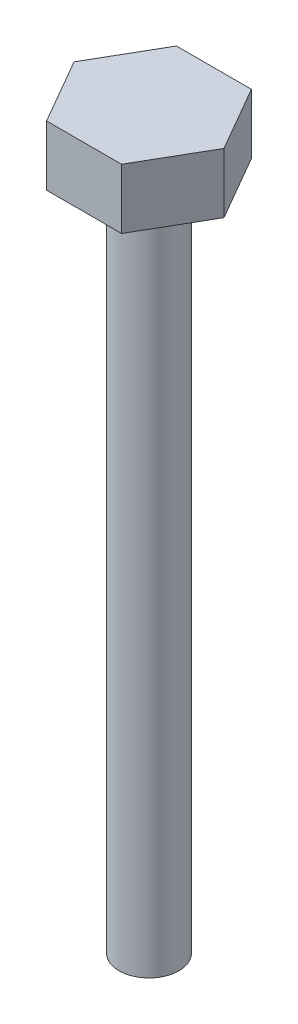
ISO-10303-21;
HEADER;
FILE_DESCRIPTION(('STEP AP214'),'2;1');
FILE_NAME('part.step','',(''),(''),'','','');
FILE_SCHEMA(('AUTOMOTIVE_DESIGN { 1 0 10303 214 1 1 1 1 }'));
ENDSEC;
DATA;
#1=APPLICATION_CONTEXT('core data for automotive mechanical design processes');
#2=APPLICATION_PROTOCOL_DEFINITION('international standard','automotive_design',2000,#1);
#3=PRODUCT_CONTEXT('',#1,'mechanical');
#4=PRODUCT('Part','Part','',(#3));
#5=PRODUCT_RELATED_PRODUCT_CATEGORY('part','',(#4));
#6=PRODUCT_DEFINITION_FORMATION('','',#4);
#7=PRODUCT_DEFINITION_CONTEXT('part definition',#1,'design');
#8=PRODUCT_DEFINITION('design','',#6,#7);
#9=PRODUCT_DEFINITION_SHAPE('','',#8);
#10=(LENGTH_UNIT() NAMED_UNIT(*) SI_UNIT(.MILLI.,.METRE.));
#11=(NAMED_UNIT(*) PLANE_ANGLE_UNIT() SI_UNIT($,.RADIAN.));
#12=(NAMED_UNIT(*) SI_UNIT($,.STERADIAN.) SOLID_ANGLE_UNIT());
#13=UNCERTAINTY_MEASURE_WITH_UNIT(LENGTH_MEASURE(1.E-05),#10,'distance_accuracy_value','');
#14=(GEOMETRIC_REPRESENTATION_CONTEXT(3) GLOBAL_UNCERTAINTY_ASSIGNED_CONTEXT((#13)) GLOBAL_UNIT_ASSIGNED_CONTEXT((#10,
#11,#12)) REPRESENTATION_CONTEXT('',''));
#15=CARTESIAN_POINT('',(0.,0.,0.));
#16=DIRECTION('',(0.,0.,1.));
#17=DIRECTION('',(1.,0.,0.));
#18=AXIS2_PLACEMENT_3D('',#15,#16,#17);
#19=CARTESIAN_POINT('',(2.50000000000005,4.,4.33012701892216));
#20=DIRECTION('',(-0.866025403784441,0.,-0.499999999999995));
#21=DIRECTION('',(-0.499999999999995,0.,0.866025403784441));
#22=AXIS2_PLACEMENT_3D('',#19,#20,#21);
#23=PLANE('',#22);
#24=DIRECTION('',(0.499999999999995,0.,-0.866025403784441));
#25=VECTOR('',#24,1.);
#26=CARTESIAN_POINT('',(2.50000000000005,0.,4.33012701892216));
#27=LINE('',#26,#25);
#28=CARTESIAN_POINT('',(2.50000000000005,0.,4.33012701892216));
#29=VERTEX_POINT('',#28);
#30=CARTESIAN_POINT('',(5.,0.,0.));
#31=VERTEX_POINT('',#30);
#32=EDGE_CURVE('E125',#29,#31,#27,.T.);
#33=ORIENTED_EDGE('',*,*,#32,.T.);
#34=DIRECTION('',(0.,-1.,0.));
#35=VECTOR('',#34,1.);
#36=CARTESIAN_POINT('',(5.,4.,0.));
#37=LINE('',#36,#35);
#38=CARTESIAN_POINT('',(5.,4.,0.));
#39=VERTEX_POINT('',#38);
#40=EDGE_CURVE('E42',#39,#31,#37,.T.);
#41=ORIENTED_EDGE('',*,*,#40,.F.);
#42=DIRECTION('',(0.499999999999995,0.,-0.866025403784441));
#43=VECTOR('',#42,1.);
#44=CARTESIAN_POINT('',(2.50000000000005,4.,4.33012701892216));
#45=LINE('',#44,#43);
#46=CARTESIAN_POINT('',(2.50000000000005,4.,4.33012701892216));
#47=VERTEX_POINT('',#46);
#48=EDGE_CURVE('E136',#47,#39,#45,.T.);
#49=ORIENTED_EDGE('',*,*,#48,.F.);
#50=DIRECTION('',(0.,-1.,0.));
#51=VECTOR('',#50,1.);
#52=CARTESIAN_POINT('',(2.50000000000005,4.,4.33012701892216));
#53=LINE('',#52,#51);
#54=EDGE_CURVE('E121',#47,#29,#53,.T.);
#55=ORIENTED_EDGE('',*,*,#54,.T.);
#56=EDGE_LOOP('',(#33,#41,#49,#55));
#57=FACE_BOUND('',#56,.T.);
#58=ADVANCED_FACE('F39',(#57),#23,.F.);
#59=CARTESIAN_POINT('',(5.,4.,0.));
#60=DIRECTION('',(-0.866025403784438,0.,0.500000000000001));
#61=DIRECTION('',(0.500000000000001,0.,0.866025403784438));
#62=AXIS2_PLACEMENT_3D('',#59,#60,#61);
#63=PLANE('',#62);
#64=DIRECTION('',(-0.500000000000001,0.,-0.866025403784438));
#65=VECTOR('',#64,1.);
#66=CARTESIAN_POINT('',(5.,0.,0.));
#67=LINE('',#66,#65);
#68=CARTESIAN_POINT('',(2.49999999999999,0.,-4.3301270189222));
#69=VERTEX_POINT('',#68);
#70=EDGE_CURVE('E128',#31,#69,#67,.T.);
#71=ORIENTED_EDGE('',*,*,#70,.T.);
#72=DIRECTION('',(0.,-1.,0.));
#73=VECTOR('',#72,1.);
#74=CARTESIAN_POINT('',(2.49999999999999,4.,-4.3301270189222));
#75=LINE('',#74,#73);
#76=CARTESIAN_POINT('',(2.49999999999999,4.,-4.3301270189222));
#77=VERTEX_POINT('',#76);
#78=EDGE_CURVE('E139',#77,#69,#75,.T.);
#79=ORIENTED_EDGE('',*,*,#78,.F.);
#80=DIRECTION('',(-0.500000000000001,0.,-0.866025403784438));
#81=VECTOR('',#80,1.);
#82=CARTESIAN_POINT('',(5.,4.,0.));
#83=LINE('',#82,#81);
#84=EDGE_CURVE('E94',#39,#77,#83,.T.);
#85=ORIENTED_EDGE('',*,*,#84,.F.);
#86=ORIENTED_EDGE('',*,*,#40,.T.);
#87=EDGE_LOOP('',(#71,#79,#85,#86));
#88=FACE_BOUND('',#87,.T.);
#89=ADVANCED_FACE('F144',(#88),#63,.F.);
#90=CARTESIAN_POINT('',(2.49999999999999,4.,-4.3301270189222));
#91=DIRECTION('',(0.,0.,1.));
#92=DIRECTION('',(1.,0.,0.));
#93=AXIS2_PLACEMENT_3D('',#90,#91,#92);
#94=PLANE('',#93);
#95=DIRECTION('',(-1.,0.,0.));
#96=VECTOR('',#95,1.);
#97=CARTESIAN_POINT('',(2.49999999999999,0.,-4.3301270189222));
#98=LINE('',#97,#96);
#99=CARTESIAN_POINT('',(-2.50000000000002,0.,-4.33012701892218));
#100=VERTEX_POINT('',#99);
#101=EDGE_CURVE('E131',#69,#100,#98,.T.);
#102=ORIENTED_EDGE('',*,*,#101,.T.);
#103=DIRECTION('',(0.,-1.,0.));
#104=VECTOR('',#103,1.);
#105=CARTESIAN_POINT('',(-2.50000000000002,4.,-4.33012701892218));
#106=LINE('',#105,#104);
#107=CARTESIAN_POINT('',(-2.50000000000002,4.,-4.33012701892218));
#108=VERTEX_POINT('',#107);
#109=EDGE_CURVE('E116',#108,#100,#106,.T.);
#110=ORIENTED_EDGE('',*,*,#109,.F.);
#111=DIRECTION('',(-1.,0.,0.));
#112=VECTOR('',#111,1.);
#113=CARTESIAN_POINT('',(2.49999999999999,4.,-4.3301270189222));
#114=LINE('',#113,#112);
#115=EDGE_CURVE('E107',#77,#108,#114,.T.);
#116=ORIENTED_EDGE('',*,*,#115,.F.);
#117=ORIENTED_EDGE('',*,*,#78,.T.);
#118=EDGE_LOOP('',(#102,#110,#116,#117));
#119=FACE_BOUND('',#118,.T.);
#120=ADVANCED_FACE('F150',(#119),#94,.F.);
#121=CARTESIAN_POINT('',(-2.50000000000002,4.,-4.33012701892218));
#122=DIRECTION('',(0.866025403784442,0.,0.499999999999995));
#123=DIRECTION('',(0.499999999999995,0.,-0.866025403784442));
#124=AXIS2_PLACEMENT_3D('',#121,#122,#123);
#125=PLANE('',#124);
#126=DIRECTION('',(-0.499999999999995,0.,0.866025403784442));
#127=VECTOR('',#126,1.);
#128=CARTESIAN_POINT('',(-2.50000000000002,0.,-4.33012701892218));
#129=LINE('',#128,#127);
#130=CARTESIAN_POINT('',(-5.,0.,0.));
#131=VERTEX_POINT('',#130);
#132=EDGE_CURVE('E115',#100,#131,#129,.T.);
#133=ORIENTED_EDGE('',*,*,#132,.T.);
#134=DIRECTION('',(0.,-1.,0.));
#135=VECTOR('',#134,1.);
#136=CARTESIAN_POINT('',(-5.,4.,0.));
#137=LINE('',#136,#135);
#138=CARTESIAN_POINT('',(-5.,4.,0.));
#139=VERTEX_POINT('',#138);
#140=EDGE_CURVE('E112',#139,#131,#137,.T.);
#141=ORIENTED_EDGE('',*,*,#140,.F.);
#142=DIRECTION('',(-0.499999999999995,0.,0.866025403784442));
#143=VECTOR('',#142,1.);
#144=CARTESIAN_POINT('',(-2.50000000000002,4.,-4.33012701892218));
#145=LINE('',#144,#143);
#146=EDGE_CURVE('E101',#108,#139,#145,.T.);
#147=ORIENTED_EDGE('',*,*,#146,.F.);
#148=ORIENTED_EDGE('',*,*,#109,.T.);
#149=EDGE_LOOP('',(#133,#141,#147,#148));
#150=FACE_BOUND('',#149,.T.);
#151=ADVANCED_FACE('F113',(#150),#125,.F.);
#152=CARTESIAN_POINT('',(-5.,4.,0.));
#153=DIRECTION('',(0.866025403784435,0.,-0.500000000000007));
#154=DIRECTION('',(-0.500000000000007,0.,-0.866025403784435));
#155=AXIS2_PLACEMENT_3D('',#152,#153,#154);
#156=PLANE('',#155);
#157=DIRECTION('',(0.500000000000007,0.,0.866025403784434));
#158=VECTOR('',#157,1.);
#159=CARTESIAN_POINT('',(-5.,0.,0.));
#160=LINE('',#159,#158);
#161=CARTESIAN_POINT('',(-2.49999999999996,0.,4.33012701892222));
#162=VERTEX_POINT('',#161);
#163=EDGE_CURVE('E79',#131,#162,#160,.T.);
#164=ORIENTED_EDGE('',*,*,#163,.T.);
#165=DIRECTION('',(0.,-1.,0.));
#166=VECTOR('',#165,1.);
#167=CARTESIAN_POINT('',(-2.49999999999996,4.,4.33012701892222));
#168=LINE('',#167,#166);
#169=CARTESIAN_POINT('',(-2.49999999999996,4.,4.33012701892222));
#170=VERTEX_POINT('',#169);
#171=EDGE_CURVE('E117',#170,#162,#168,.T.);
#172=ORIENTED_EDGE('',*,*,#171,.F.);
#173=DIRECTION('',(0.500000000000007,0.,0.866025403784434));
#174=VECTOR('',#173,1.);
#175=CARTESIAN_POINT('',(-5.,4.,0.));
#176=LINE('',#175,#174);
#177=EDGE_CURVE('E105',#139,#170,#176,.T.);
#178=ORIENTED_EDGE('',*,*,#177,.F.);
#179=ORIENTED_EDGE('',*,*,#140,.T.);
#180=EDGE_LOOP('',(#164,#172,#178,#179));
#181=FACE_BOUND('',#180,.T.);
#182=ADVANCED_FACE('F119',(#181),#156,.F.);
#183=CARTESIAN_POINT('',(-2.49999999999996,4.,4.33012701892222));
#184=DIRECTION('',(0.,0.,-1.));
#185=DIRECTION('',(-1.,0.,0.));
#186=AXIS2_PLACEMENT_3D('',#183,#184,#185);
#187=PLANE('',#186);
#188=DIRECTION('',(1.,0.,0.));
#189=VECTOR('',#188,1.);
#190=CARTESIAN_POINT('',(-2.49999999999996,0.,4.33012701892222));
#191=LINE('',#190,#189);
#192=EDGE_CURVE('E85',#162,#29,#191,.T.);
#193=ORIENTED_EDGE('',*,*,#192,.T.);
#194=ORIENTED_EDGE('',*,*,#54,.F.);
#195=DIRECTION('',(1.,0.,0.));
#196=VECTOR('',#195,1.);
#197=CARTESIAN_POINT('',(-2.49999999999996,4.,4.33012701892222));
#198=LINE('',#197,#196);
#199=EDGE_CURVE('E56',#170,#47,#198,.T.);
#200=ORIENTED_EDGE('',*,*,#199,.F.);
#201=ORIENTED_EDGE('',*,*,#171,.T.);
#202=EDGE_LOOP('',(#193,#194,#200,#201));
#203=FACE_BOUND('',#202,.T.);
#204=ADVANCED_FACE('F170',(#203),#187,.F.);
#205=CARTESIAN_POINT('',(0.,4.,0.));
#206=DIRECTION('',(0.,1.,0.));
#207=DIRECTION('',(0.,0.,1.));
#208=AXIS2_PLACEMENT_3D('',#205,#206,#207);
#209=PLANE('',#208);
#210=ORIENTED_EDGE('',*,*,#48,.T.);
#211=ORIENTED_EDGE('',*,*,#84,.T.);
#212=ORIENTED_EDGE('',*,*,#115,.T.);
#213=ORIENTED_EDGE('',*,*,#146,.T.);
#214=ORIENTED_EDGE('',*,*,#177,.T.);
#215=ORIENTED_EDGE('',*,*,#199,.T.);
#216=EDGE_LOOP('',(#210,#211,#212,#213,#214,#215));
#217=FACE_BOUND('',#216,.T.);
#218=ADVANCED_FACE('F103',(#217),#209,.T.);
#219=CARTESIAN_POINT('',(0.,0.,0.));
#220=DIRECTION('',(0.,1.,0.));
#221=DIRECTION('',(0.,0.,1.));
#222=AXIS2_PLACEMENT_3D('',#219,#220,#221);
#223=PLANE('',#222);
#224=CARTESIAN_POINT('',(0.,0.,0.));
#225=DIRECTION('',(0.,-1.,0.));
#226=DIRECTION('',(0.,0.,-1.));
#227=AXIS2_PLACEMENT_3D('',#224,#225,#226);
#228=CIRCLE('',#227,2.);
#229=CARTESIAN_POINT('',(0.,0.,-2.));
#230=VERTEX_POINT('',#229);
#231=EDGE_CURVE('E11',#230,#230,#228,.T.);
#232=ORIENTED_EDGE('',*,*,#231,.F.);
#233=EDGE_LOOP('',(#232));
#234=FACE_BOUND('',#233,.T.);
#235=ORIENTED_EDGE('',*,*,#32,.F.);
#236=ORIENTED_EDGE('',*,*,#192,.F.);
#237=ORIENTED_EDGE('',*,*,#163,.F.);
#238=ORIENTED_EDGE('',*,*,#132,.F.);
#239=ORIENTED_EDGE('',*,*,#101,.F.);
#240=ORIENTED_EDGE('',*,*,#70,.F.);
#241=EDGE_LOOP('',(#235,#236,#237,#238,#239,#240));
#242=FACE_BOUND('',#241,.T.);
#243=ADVANCED_FACE('F149',(#234,#242),#223,.F.);
#244=CARTESIAN_POINT('',(0.,-45.,0.));
#245=DIRECTION('',(0.,1.,0.));
#246=DIRECTION('',(0.,0.,1.));
#247=AXIS2_PLACEMENT_3D('',#244,#245,#246);
#248=CYLINDRICAL_SURFACE('',#247,2.);
#249=CARTESIAN_POINT('',(0.,-45.,0.));
#250=DIRECTION('',(0.,-1.,0.));
#251=DIRECTION('',(0.,0.,-1.));
#252=AXIS2_PLACEMENT_3D('',#249,#250,#251);
#253=CIRCLE('',#252,2.);
#254=CARTESIAN_POINT('',(0.,-45.,-2.));
#255=VERTEX_POINT('',#254);
#256=EDGE_CURVE('E129',#255,#255,#253,.T.);
#257=ORIENTED_EDGE('',*,*,#256,.F.);
#258=EDGE_LOOP('',(#257));
#259=FACE_BOUND('',#258,.T.);
#260=ORIENTED_EDGE('',*,*,#231,.T.);
#261=EDGE_LOOP('',(#260));
#262=FACE_BOUND('',#261,.T.);
#263=ADVANCED_FACE('F159',(#259,#262),#248,.T.);
#264=CARTESIAN_POINT('',(0.,-45.,0.));
#265=DIRECTION('',(0.,-1.,0.));
#266=DIRECTION('',(0.,0.,-1.));
#267=AXIS2_PLACEMENT_3D('',#264,#265,#266);
#268=PLANE('',#267);
#269=ORIENTED_EDGE('',*,*,#256,.T.);
#270=EDGE_LOOP('',(#269));
#271=FACE_BOUND('',#270,.T.);
#272=ADVANCED_FACE('F157',(#271),#268,.T.);
#273=CLOSED_SHELL('',(#58,#89,#120,#151,#182,#204,#218,#243,#263,#272));
#274=MANIFOLD_SOLID_BREP('B2',#273);
#275=ADVANCED_BREP_SHAPE_REPRESENTATION('',(#18,#274),#14);
#276=SHAPE_DEFINITION_REPRESENTATION(#9,#275);
ENDSEC;
END-ISO-10303-21;
